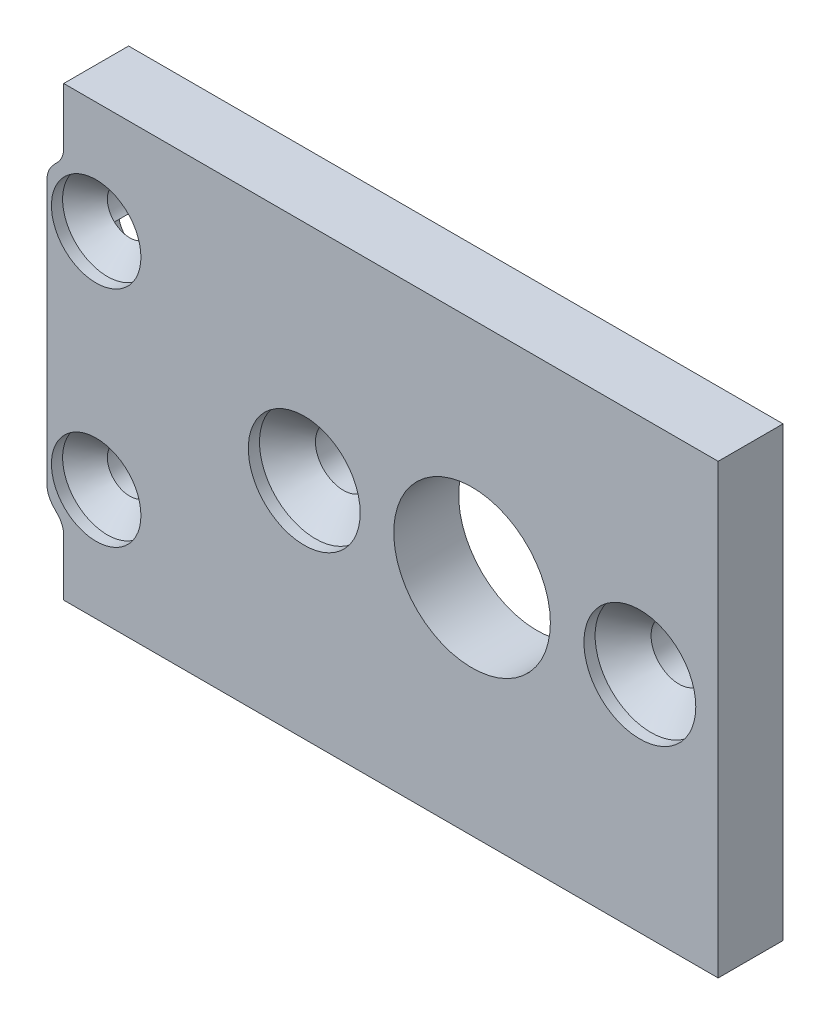
ISO-10303-21;
HEADER;
FILE_DESCRIPTION(('STEP AP214'),'2;1');
FILE_NAME('part.step','',(''),(''),'','','');
FILE_SCHEMA(('AUTOMOTIVE_DESIGN { 1 0 10303 214 1 1 1 1 }'));
ENDSEC;
DATA;
#1=APPLICATION_CONTEXT('core data for automotive mechanical design processes');
#2=APPLICATION_PROTOCOL_DEFINITION('international standard','automotive_design',2000,#1);
#3=PRODUCT_CONTEXT('',#1,'mechanical');
#4=PRODUCT('Part','Part','',(#3));
#5=PRODUCT_RELATED_PRODUCT_CATEGORY('part','',(#4));
#6=PRODUCT_DEFINITION_FORMATION('','',#4);
#7=PRODUCT_DEFINITION_CONTEXT('part definition',#1,'design');
#8=PRODUCT_DEFINITION('design','',#6,#7);
#9=PRODUCT_DEFINITION_SHAPE('','',#8);
#10=(LENGTH_UNIT() NAMED_UNIT(*) SI_UNIT(.MILLI.,.METRE.));
#11=(NAMED_UNIT(*) PLANE_ANGLE_UNIT() SI_UNIT($,.RADIAN.));
#12=(NAMED_UNIT(*) SI_UNIT($,.STERADIAN.) SOLID_ANGLE_UNIT());
#13=UNCERTAINTY_MEASURE_WITH_UNIT(LENGTH_MEASURE(1.E-05),#10,'distance_accuracy_value','');
#14=(GEOMETRIC_REPRESENTATION_CONTEXT(3) GLOBAL_UNCERTAINTY_ASSIGNED_CONTEXT((#13)) GLOBAL_UNIT_ASSIGNED_CONTEXT((#10,
#11,#12)) REPRESENTATION_CONTEXT('',''));
#15=CARTESIAN_POINT('',(0.,0.,0.));
#16=DIRECTION('',(0.,0.,1.));
#17=DIRECTION('',(1.,0.,0.));
#18=AXIS2_PLACEMENT_3D('',#15,#16,#17);
#19=CARTESIAN_POINT('',(0.,0.,-2.9));
#20=DIRECTION('',(0.,0.,1.));
#21=DIRECTION('',(1.,0.,0.));
#22=AXIS2_PLACEMENT_3D('',#19,#20,#21);
#23=PLANE('',#22);
#24=DIRECTION('',(-1.,0.,0.));
#25=VECTOR('',#24,1.);
#26=CARTESIAN_POINT('',(-92.5,10.,-2.9));
#27=LINE('',#26,#25);
#28=CARTESIAN_POINT('',(-62.5,10.,-2.9));
#29=VERTEX_POINT('',#28);
#30=CARTESIAN_POINT('',(-91.75,10.,-2.9));
#31=VERTEX_POINT('',#30);
#32=EDGE_CURVE('E478',#29,#31,#27,.T.);
#33=ORIENTED_EDGE('',*,*,#32,.F.);
#34=DIRECTION('',(0.,1.,0.));
#35=VECTOR('',#34,1.);
#36=CARTESIAN_POINT('',(-62.5,-10.,-2.9));
#37=LINE('',#36,#35);
#38=CARTESIAN_POINT('',(-62.5,-10.,-2.9));
#39=VERTEX_POINT('',#38);
#40=EDGE_CURVE('E343',#39,#29,#37,.T.);
#41=ORIENTED_EDGE('',*,*,#40,.F.);
#42=DIRECTION('',(1.,0.,0.));
#43=VECTOR('',#42,1.);
#44=CARTESIAN_POINT('',(-92.5,-10.,-2.9));
#45=LINE('',#44,#43);
#46=CARTESIAN_POINT('',(-91.75,-10.,-2.9));
#47=VERTEX_POINT('',#46);
#48=EDGE_CURVE('E477',#47,#39,#45,.T.);
#49=ORIENTED_EDGE('',*,*,#48,.F.);
#50=DIRECTION('',(0.,1.,0.));
#51=VECTOR('',#50,1.);
#52=CARTESIAN_POINT('',(-91.75,0.,-2.9));
#53=LINE('',#52,#51);
#54=CARTESIAN_POINT('',(-91.75,-7.49949994998999,-2.9));
#55=VERTEX_POINT('',#54);
#56=EDGE_CURVE('E674',#47,#55,#53,.T.);
#57=ORIENTED_EDGE('',*,*,#56,.T.);
#58=CARTESIAN_POINT('',(-92.75,-7.49949994998999,-2.9));
#59=DIRECTION('',(0.,0.,1.));
#60=DIRECTION('',(1.,0.,0.));
#61=AXIS2_PLACEMENT_3D('',#58,#59,#60);
#62=CIRCLE('',#61,1.);
#63=CARTESIAN_POINT('',(-92.05,-6.78535710713571,-2.9));
#64=VERTEX_POINT('',#63);
#65=EDGE_CURVE('E531',#55,#64,#62,.T.);
#66=ORIENTED_EDGE('',*,*,#65,.T.);
#67=CARTESIAN_POINT('',(-90.3,-5.00000000000002,-2.9));
#68=DIRECTION('',(0.,0.,1.));
#69=DIRECTION('',(1.,0.,0.));
#70=AXIS2_PLACEMENT_3D('',#67,#68,#69);
#71=CIRCLE('',#70,2.5);
#72=CARTESIAN_POINT('',(-92.3,-6.49999999999997,-2.9));
#73=VERTEX_POINT('',#72);
#74=EDGE_CURVE('E676',#64,#73,#71,.F.);
#75=ORIENTED_EDGE('',*,*,#74,.T.);
#76=CARTESIAN_POINT('',(-91.5,-5.89999999999999,-2.9));
#77=DIRECTION('',(0.,0.,1.));
#78=DIRECTION('',(1.,0.,0.));
#79=AXIS2_PLACEMENT_3D('',#76,#77,#78);
#80=CIRCLE('',#79,1.);
#81=CARTESIAN_POINT('',(-92.5,-5.89999999999999,-2.9));
#82=VERTEX_POINT('',#81);
#83=EDGE_CURVE('E519',#73,#82,#80,.F.);
#84=ORIENTED_EDGE('',*,*,#83,.T.);
#85=DIRECTION('',(0.,-1.,0.));
#86=VECTOR('',#85,1.);
#87=CARTESIAN_POINT('',(-92.5,10.,-2.9));
#88=LINE('',#87,#86);
#89=CARTESIAN_POINT('',(-92.5,5.89999999999994,-2.9));
#90=VERTEX_POINT('',#89);
#91=EDGE_CURVE('E486',#90,#82,#88,.T.);
#92=ORIENTED_EDGE('',*,*,#91,.F.);
#93=CARTESIAN_POINT('',(-91.5,5.89999999999994,-2.9));
#94=DIRECTION('',(0.,0.,1.));
#95=DIRECTION('',(1.,0.,0.));
#96=AXIS2_PLACEMENT_3D('',#93,#94,#95);
#97=CIRCLE('',#96,1.);
#98=CARTESIAN_POINT('',(-92.3,6.49999999999993,-2.9));
#99=VERTEX_POINT('',#98);
#100=EDGE_CURVE('E517',#90,#99,#97,.F.);
#101=ORIENTED_EDGE('',*,*,#100,.T.);
#102=CARTESIAN_POINT('',(-90.3,4.99999999999998,-2.9));
#103=DIRECTION('',(0.,0.,1.));
#104=DIRECTION('',(1.,0.,0.));
#105=AXIS2_PLACEMENT_3D('',#102,#103,#104);
#106=CIRCLE('',#105,2.5);
#107=CARTESIAN_POINT('',(-92.05,6.78535710713567,-2.9));
#108=VERTEX_POINT('',#107);
#109=EDGE_CURVE('E548',#99,#108,#106,.F.);
#110=ORIENTED_EDGE('',*,*,#109,.T.);
#111=CARTESIAN_POINT('',(-92.75,7.49949994998995,-2.9));
#112=DIRECTION('',(0.,0.,1.));
#113=DIRECTION('',(1.,0.,0.));
#114=AXIS2_PLACEMENT_3D('',#111,#112,#113);
#115=CIRCLE('',#114,1.);
#116=CARTESIAN_POINT('',(-91.75,7.49949994998995,-2.9));
#117=VERTEX_POINT('',#116);
#118=EDGE_CURVE('E12',#108,#117,#115,.T.);
#119=ORIENTED_EDGE('',*,*,#118,.T.);
#120=DIRECTION('',(0.,1.,0.));
#121=VECTOR('',#120,1.);
#122=CARTESIAN_POINT('',(-91.75,0.,-2.9));
#123=LINE('',#122,#121);
#124=EDGE_CURVE('E554',#117,#31,#123,.T.);
#125=ORIENTED_EDGE('',*,*,#124,.T.);
#126=EDGE_LOOP('',(#33,#41,#49,#57,#66,#75,#84,#92,#101,#110,#119,#125));
#127=FACE_BOUND('',#126,.T.);
#128=CARTESIAN_POINT('',(-66.,0.,-2.9));
#129=DIRECTION('',(0.,0.,1.));
#130=DIRECTION('',(1.,0.,0.));
#131=AXIS2_PLACEMENT_3D('',#128,#129,#130);
#132=CIRCLE('',#131,1.25);
#133=CARTESIAN_POINT('',(-64.75,0.,-2.9));
#134=VERTEX_POINT('',#133);
#135=EDGE_CURVE('E665',#134,#134,#132,.T.);
#136=ORIENTED_EDGE('',*,*,#135,.T.);
#137=EDGE_LOOP('',(#136));
#138=FACE_BOUND('',#137,.T.);
#139=CARTESIAN_POINT('',(-73.5,0.,-2.9));
#140=DIRECTION('',(0.,0.,1.));
#141=DIRECTION('',(1.,0.,0.));
#142=AXIS2_PLACEMENT_3D('',#139,#140,#141);
#143=CIRCLE('',#142,3.50000000000001);
#144=CARTESIAN_POINT('',(-70.,0.,-2.9));
#145=VERTEX_POINT('',#144);
#146=EDGE_CURVE('E659',#145,#145,#143,.F.);
#147=ORIENTED_EDGE('',*,*,#146,.F.);
#148=EDGE_LOOP('',(#147));
#149=FACE_BOUND('',#148,.T.);
#150=CARTESIAN_POINT('',(-81.,0.,-2.9));
#151=DIRECTION('',(0.,0.,1.));
#152=DIRECTION('',(1.,0.,0.));
#153=AXIS2_PLACEMENT_3D('',#150,#151,#152);
#154=CIRCLE('',#153,1.25);
#155=CARTESIAN_POINT('',(-79.75,0.,-2.9));
#156=VERTEX_POINT('',#155);
#157=EDGE_CURVE('E499',#156,#156,#154,.F.);
#158=ORIENTED_EDGE('',*,*,#157,.F.);
#159=EDGE_LOOP('',(#158));
#160=FACE_BOUND('',#159,.T.);
#161=CARTESIAN_POINT('',(-90.3,-5.00000000000002,-2.9));
#162=DIRECTION('',(0.,0.,1.));
#163=DIRECTION('',(1.,0.,0.));
#164=AXIS2_PLACEMENT_3D('',#161,#162,#163);
#165=CIRCLE('',#164,0.999999999999998);
#166=CARTESIAN_POINT('',(-89.6155672359768,-4.27092401525527,-2.9));
#167=VERTEX_POINT('',#166);
#168=CARTESIAN_POINT('',(-90.9844327640232,-4.27092401525527,-2.9));
#169=VERTEX_POINT('',#168);
#170=EDGE_CURVE('E634',#167,#169,#165,.F.);
#171=ORIENTED_EDGE('',*,*,#170,.F.);
#172=CARTESIAN_POINT('',(-89.4071067811865,-3.29289321881344,-2.9));
#173=DIRECTION('',(0.,0.,-1.));
#174=DIRECTION('',(-1.,0.,0.));
#175=AXIS2_PLACEMENT_3D('',#172,#173,#174);
#176=CIRCLE('',#175,0.999999999999998);
#177=CARTESIAN_POINT('',(-88.7,-2.58578643762689,-2.9));
#178=VERTEX_POINT('',#177);
#179=EDGE_CURVE('E556',#178,#167,#176,.T.);
#180=ORIENTED_EDGE('',*,*,#179,.F.);
#181=DIRECTION('',(0.,-1.,0.));
#182=VECTOR('',#181,1.);
#183=CARTESIAN_POINT('',(-88.7,4.00000000000002,-2.9));
#184=LINE('',#183,#182);
#185=CARTESIAN_POINT('',(-88.7,2.58578643762689,-2.9));
#186=VERTEX_POINT('',#185);
#187=EDGE_CURVE('E583',#186,#178,#184,.T.);
#188=ORIENTED_EDGE('',*,*,#187,.F.);
#189=CARTESIAN_POINT('',(-89.4071067811865,3.29289321881344,-2.9));
#190=DIRECTION('',(0.,0.,1.));
#191=DIRECTION('',(1.,0.,0.));
#192=AXIS2_PLACEMENT_3D('',#189,#190,#191);
#193=CIRCLE('',#192,0.999999999999998);
#194=CARTESIAN_POINT('',(-89.6155672359767,4.27092401525529,-2.9));
#195=VERTEX_POINT('',#194);
#196=EDGE_CURVE('E592',#186,#195,#193,.T.);
#197=ORIENTED_EDGE('',*,*,#196,.T.);
#198=CARTESIAN_POINT('',(-90.3,4.99999999999998,-2.9));
#199=DIRECTION('',(0.,0.,1.));
#200=DIRECTION('',(1.,0.,0.));
#201=AXIS2_PLACEMENT_3D('',#198,#199,#200);
#202=CIRCLE('',#201,0.999999999999998);
#203=CARTESIAN_POINT('',(-90.9844327640233,4.27092401525528,-2.9));
#204=VERTEX_POINT('',#203);
#205=EDGE_CURVE('E633',#204,#195,#202,.F.);
#206=ORIENTED_EDGE('',*,*,#205,.F.);
#207=CARTESIAN_POINT('',(-91.1928932188135,3.29289321881344,-2.9));
#208=DIRECTION('',(0.,0.,-1.));
#209=DIRECTION('',(-1.,0.,0.));
#210=AXIS2_PLACEMENT_3D('',#207,#208,#209);
#211=CIRCLE('',#210,0.999999999999998);
#212=CARTESIAN_POINT('',(-91.9,2.58578643762685,-2.9));
#213=VERTEX_POINT('',#212);
#214=EDGE_CURVE('E598',#213,#204,#211,.T.);
#215=ORIENTED_EDGE('',*,*,#214,.F.);
#216=DIRECTION('',(0.,-1.,0.));
#217=VECTOR('',#216,1.);
#218=CARTESIAN_POINT('',(-91.9,4.00000000000002,-2.9));
#219=LINE('',#218,#217);
#220=CARTESIAN_POINT('',(-91.9,-2.58578643762685,-2.9));
#221=VERTEX_POINT('',#220);
#222=EDGE_CURVE('E579',#213,#221,#219,.T.);
#223=ORIENTED_EDGE('',*,*,#222,.T.);
#224=CARTESIAN_POINT('',(-91.1928932188135,-3.29289321881344,-2.9));
#225=DIRECTION('',(0.,0.,1.));
#226=DIRECTION('',(1.,0.,0.));
#227=AXIS2_PLACEMENT_3D('',#224,#225,#226);
#228=CIRCLE('',#227,0.999999999999998);
#229=EDGE_CURVE('E604',#221,#169,#228,.T.);
#230=ORIENTED_EDGE('',*,*,#229,.T.);
#231=EDGE_LOOP('',(#171,#180,#188,#197,#206,#215,#223,#230));
#232=FACE_BOUND('',#231,.T.);
#233=ADVANCED_FACE('F328',(#127,#138,#149,#160,#232),#23,.F.);
#234=CARTESIAN_POINT('',(0.,0.,0.));
#235=DIRECTION('',(0.,0.,1.));
#236=DIRECTION('',(1.,0.,0.));
#237=AXIS2_PLACEMENT_3D('',#234,#235,#236);
#238=PLANE('',#237);
#239=DIRECTION('',(0.,-1.,0.));
#240=VECTOR('',#239,1.);
#241=CARTESIAN_POINT('',(-62.5,-10.,0.));
#242=LINE('',#241,#240);
#243=CARTESIAN_POINT('',(-62.5,10.,0.));
#244=VERTEX_POINT('',#243);
#245=CARTESIAN_POINT('',(-62.5,-10.,0.));
#246=VERTEX_POINT('',#245);
#247=EDGE_CURVE('E466',#244,#246,#242,.T.);
#248=ORIENTED_EDGE('',*,*,#247,.F.);
#249=DIRECTION('',(-1.,0.,0.));
#250=VECTOR('',#249,1.);
#251=CARTESIAN_POINT('',(-92.5,10.,0.));
#252=LINE('',#251,#250);
#253=CARTESIAN_POINT('',(-91.75,10.,0.));
#254=VERTEX_POINT('',#253);
#255=EDGE_CURVE('E496',#244,#254,#252,.T.);
#256=ORIENTED_EDGE('',*,*,#255,.T.);
#257=DIRECTION('',(0.,-1.,0.));
#258=VECTOR('',#257,1.);
#259=CARTESIAN_POINT('',(-91.75,0.,0.));
#260=LINE('',#259,#258);
#261=CARTESIAN_POINT('',(-91.75,7.49949994998995,0.));
#262=VERTEX_POINT('',#261);
#263=EDGE_CURVE('E540',#254,#262,#260,.T.);
#264=ORIENTED_EDGE('',*,*,#263,.T.);
#265=CARTESIAN_POINT('',(-92.75,7.49949994998995,0.));
#266=DIRECTION('',(0.,0.,1.));
#267=DIRECTION('',(1.,0.,0.));
#268=AXIS2_PLACEMENT_3D('',#265,#266,#267);
#269=CIRCLE('',#268,1.);
#270=CARTESIAN_POINT('',(-92.05,6.78535710713567,0.));
#271=VERTEX_POINT('',#270);
#272=EDGE_CURVE('E336',#262,#271,#269,.F.);
#273=ORIENTED_EDGE('',*,*,#272,.T.);
#274=CARTESIAN_POINT('',(-90.3,4.99999999999998,0.));
#275=DIRECTION('',(0.,0.,1.));
#276=DIRECTION('',(1.,0.,0.));
#277=AXIS2_PLACEMENT_3D('',#274,#275,#276);
#278=CIRCLE('',#277,2.5);
#279=CARTESIAN_POINT('',(-92.3,6.49999999999993,0.));
#280=VERTEX_POINT('',#279);
#281=EDGE_CURVE('E538',#271,#280,#278,.T.);
#282=ORIENTED_EDGE('',*,*,#281,.T.);
#283=CARTESIAN_POINT('',(-91.5,5.89999999999994,0.));
#284=DIRECTION('',(0.,0.,1.));
#285=DIRECTION('',(1.,0.,0.));
#286=AXIS2_PLACEMENT_3D('',#283,#284,#285);
#287=CIRCLE('',#286,1.);
#288=CARTESIAN_POINT('',(-92.5,5.89999999999994,0.));
#289=VERTEX_POINT('',#288);
#290=EDGE_CURVE('E513',#280,#289,#287,.T.);
#291=ORIENTED_EDGE('',*,*,#290,.T.);
#292=DIRECTION('',(0.,-1.,0.));
#293=VECTOR('',#292,1.);
#294=CARTESIAN_POINT('',(-92.5,10.,0.));
#295=LINE('',#294,#293);
#296=CARTESIAN_POINT('',(-92.5,-5.89999999999999,0.));
#297=VERTEX_POINT('',#296);
#298=EDGE_CURVE('E498',#289,#297,#295,.T.);
#299=ORIENTED_EDGE('',*,*,#298,.T.);
#300=CARTESIAN_POINT('',(-91.5,-5.89999999999999,0.));
#301=DIRECTION('',(0.,0.,1.));
#302=DIRECTION('',(1.,0.,0.));
#303=AXIS2_PLACEMENT_3D('',#300,#301,#302);
#304=CIRCLE('',#303,1.);
#305=CARTESIAN_POINT('',(-92.3,-6.49999999999997,0.));
#306=VERTEX_POINT('',#305);
#307=EDGE_CURVE('E515',#297,#306,#304,.T.);
#308=ORIENTED_EDGE('',*,*,#307,.T.);
#309=CARTESIAN_POINT('',(-90.3,-5.00000000000002,0.));
#310=DIRECTION('',(0.,0.,1.));
#311=DIRECTION('',(1.,0.,0.));
#312=AXIS2_PLACEMENT_3D('',#309,#310,#311);
#313=CIRCLE('',#312,2.5);
#314=CARTESIAN_POINT('',(-92.05,-6.78535710713571,0.));
#315=VERTEX_POINT('',#314);
#316=EDGE_CURVE('E682',#306,#315,#313,.T.);
#317=ORIENTED_EDGE('',*,*,#316,.T.);
#318=CARTESIAN_POINT('',(-92.75,-7.49949994998999,0.));
#319=DIRECTION('',(0.,0.,1.));
#320=DIRECTION('',(1.,0.,0.));
#321=AXIS2_PLACEMENT_3D('',#318,#319,#320);
#322=CIRCLE('',#321,1.);
#323=CARTESIAN_POINT('',(-91.75,-7.49949994998999,0.));
#324=VERTEX_POINT('',#323);
#325=EDGE_CURVE('E529',#315,#324,#322,.F.);
#326=ORIENTED_EDGE('',*,*,#325,.T.);
#327=DIRECTION('',(0.,-1.,0.));
#328=VECTOR('',#327,1.);
#329=CARTESIAN_POINT('',(-91.75,0.,0.));
#330=LINE('',#329,#328);
#331=CARTESIAN_POINT('',(-91.75,-10.,0.));
#332=VERTEX_POINT('',#331);
#333=EDGE_CURVE('E685',#324,#332,#330,.T.);
#334=ORIENTED_EDGE('',*,*,#333,.T.);
#335=DIRECTION('',(1.,0.,0.));
#336=VECTOR('',#335,1.);
#337=CARTESIAN_POINT('',(-92.5,-10.,0.));
#338=LINE('',#337,#336);
#339=EDGE_CURVE('E502',#332,#246,#338,.T.);
#340=ORIENTED_EDGE('',*,*,#339,.T.);
#341=EDGE_LOOP('',(#248,#256,#264,#273,#282,#291,#299,#308,#317,#326,#334,#340));
#342=FACE_BOUND('',#341,.T.);
#343=CARTESIAN_POINT('',(-90.3,4.99999999999998,0.));
#344=DIRECTION('',(0.,0.,1.));
#345=DIRECTION('',(1.,0.,0.));
#346=AXIS2_PLACEMENT_3D('',#343,#344,#345);
#347=CIRCLE('',#346,2.);
#348=CARTESIAN_POINT('',(-88.3,4.99999999999998,0.));
#349=VERTEX_POINT('',#348);
#350=EDGE_CURVE('E565',#349,#349,#347,.T.);
#351=ORIENTED_EDGE('',*,*,#350,.F.);
#352=EDGE_LOOP('',(#351));
#353=FACE_BOUND('',#352,.T.);
#354=CARTESIAN_POINT('',(-90.3,-5.00000000000002,0.));
#355=DIRECTION('',(0.,0.,1.));
#356=DIRECTION('',(1.,0.,0.));
#357=AXIS2_PLACEMENT_3D('',#354,#355,#356);
#358=CIRCLE('',#357,2.);
#359=CARTESIAN_POINT('',(-88.3,-5.00000000000002,0.));
#360=VERTEX_POINT('',#359);
#361=EDGE_CURVE('E623',#360,#360,#358,.T.);
#362=ORIENTED_EDGE('',*,*,#361,.F.);
#363=EDGE_LOOP('',(#362));
#364=FACE_BOUND('',#363,.T.);
#365=CARTESIAN_POINT('',(-81.,0.,0.));
#366=DIRECTION('',(0.,0.,1.));
#367=DIRECTION('',(1.,0.,0.));
#368=AXIS2_PLACEMENT_3D('',#365,#366,#367);
#369=CIRCLE('',#368,2.5);
#370=CARTESIAN_POINT('',(-78.5,0.,0.));
#371=VERTEX_POINT('',#370);
#372=EDGE_CURVE('E638',#371,#371,#369,.T.);
#373=ORIENTED_EDGE('',*,*,#372,.F.);
#374=EDGE_LOOP('',(#373));
#375=FACE_BOUND('',#374,.T.);
#376=CARTESIAN_POINT('',(-66.,0.,0.));
#377=DIRECTION('',(0.,0.,1.));
#378=DIRECTION('',(1.,0.,0.));
#379=AXIS2_PLACEMENT_3D('',#376,#377,#378);
#380=CIRCLE('',#379,2.5);
#381=CARTESIAN_POINT('',(-63.5,0.,0.));
#382=VERTEX_POINT('',#381);
#383=EDGE_CURVE('E650',#382,#382,#380,.T.);
#384=ORIENTED_EDGE('',*,*,#383,.F.);
#385=EDGE_LOOP('',(#384));
#386=FACE_BOUND('',#385,.T.);
#387=CARTESIAN_POINT('',(-73.5,0.,0.));
#388=DIRECTION('',(0.,0.,1.));
#389=DIRECTION('',(1.,0.,0.));
#390=AXIS2_PLACEMENT_3D('',#387,#388,#389);
#391=CIRCLE('',#390,3.50000000000001);
#392=CARTESIAN_POINT('',(-70.,0.,0.));
#393=VERTEX_POINT('',#392);
#394=EDGE_CURVE('E662',#393,#393,#391,.T.);
#395=ORIENTED_EDGE('',*,*,#394,.F.);
#396=EDGE_LOOP('',(#395));
#397=FACE_BOUND('',#396,.T.);
#398=ADVANCED_FACE('F536',(#342,#353,#364,#375,#386,#397),#238,.T.);
#399=CARTESIAN_POINT('',(-92.5,10.,-2.9));
#400=DIRECTION('',(-1.,0.,0.));
#401=DIRECTION('',(0.,0.,1.));
#402=AXIS2_PLACEMENT_3D('',#399,#400,#401);
#403=PLANE('',#402);
#404=ORIENTED_EDGE('',*,*,#91,.T.);
#405=DIRECTION('',(0.,0.,1.));
#406=VECTOR('',#405,1.);
#407=CARTESIAN_POINT('',(-92.5,-5.89999999999999,-2.9));
#408=LINE('',#407,#406);
#409=EDGE_CURVE('E510',#82,#297,#408,.T.);
#410=ORIENTED_EDGE('',*,*,#409,.T.);
#411=ORIENTED_EDGE('',*,*,#298,.F.);
#412=DIRECTION('',(0.,0.,1.));
#413=VECTOR('',#412,1.);
#414=CARTESIAN_POINT('',(-92.5,5.89999999999994,-2.9));
#415=LINE('',#414,#413);
#416=EDGE_CURVE('E508',#289,#90,#415,.F.);
#417=ORIENTED_EDGE('',*,*,#416,.T.);
#418=EDGE_LOOP('',(#404,#410,#411,#417));
#419=FACE_BOUND('',#418,.T.);
#420=ADVANCED_FACE('F695',(#419),#403,.T.);
#421=CARTESIAN_POINT('',(-92.5,-10.,-2.9));
#422=DIRECTION('',(0.,-1.,0.));
#423=DIRECTION('',(0.,0.,-1.));
#424=AXIS2_PLACEMENT_3D('',#421,#422,#423);
#425=PLANE('',#424);
#426=DIRECTION('',(0.,0.,1.));
#427=VECTOR('',#426,1.);
#428=CARTESIAN_POINT('',(-62.5,-10.,-2.901));
#429=LINE('',#428,#427);
#430=EDGE_CURVE('E463',#39,#246,#429,.T.);
#431=ORIENTED_EDGE('',*,*,#430,.T.);
#432=ORIENTED_EDGE('',*,*,#339,.F.);
#433=DIRECTION('',(0.,0.,1.));
#434=VECTOR('',#433,1.);
#435=CARTESIAN_POINT('',(-91.75,-10.,-2.901));
#436=LINE('',#435,#434);
#437=EDGE_CURVE('E483',#47,#332,#436,.T.);
#438=ORIENTED_EDGE('',*,*,#437,.F.);
#439=ORIENTED_EDGE('',*,*,#48,.T.);
#440=EDGE_LOOP('',(#431,#432,#438,#439));
#441=FACE_BOUND('',#440,.T.);
#442=ADVANCED_FACE('F481',(#441),#425,.T.);
#443=CARTESIAN_POINT('',(-92.5,10.,-2.9));
#444=DIRECTION('',(0.,1.,0.));
#445=DIRECTION('',(0.,0.,1.));
#446=AXIS2_PLACEMENT_3D('',#443,#444,#445);
#447=PLANE('',#446);
#448=DIRECTION('',(0.,0.,1.));
#449=VECTOR('',#448,1.);
#450=CARTESIAN_POINT('',(-62.5,10.,-2.901));
#451=LINE('',#450,#449);
#452=EDGE_CURVE('E471',#29,#244,#451,.T.);
#453=ORIENTED_EDGE('',*,*,#452,.F.);
#454=ORIENTED_EDGE('',*,*,#32,.T.);
#455=DIRECTION('',(0.,0.,1.));
#456=VECTOR('',#455,1.);
#457=CARTESIAN_POINT('',(-91.75,10.,-2.901));
#458=LINE('',#457,#456);
#459=EDGE_CURVE('E555',#31,#254,#458,.T.);
#460=ORIENTED_EDGE('',*,*,#459,.T.);
#461=ORIENTED_EDGE('',*,*,#255,.F.);
#462=EDGE_LOOP('',(#453,#454,#460,#461));
#463=FACE_BOUND('',#462,.T.);
#464=ADVANCED_FACE('F672',(#463),#447,.T.);
#465=CARTESIAN_POINT('',(-90.3,4.99999999999998,-2.901));
#466=DIRECTION('',(0.,0.,1.));
#467=DIRECTION('',(1.,0.,0.));
#468=AXIS2_PLACEMENT_3D('',#465,#466,#467);
#469=CYLINDRICAL_SURFACE('',#468,0.999999999999998);
#470=DIRECTION('',(0.,0.,-1.));
#471=VECTOR('',#470,1.);
#472=CARTESIAN_POINT('',(-89.6155672359767,4.27092401525529,-1.5));
#473=LINE('',#472,#471);
#474=CARTESIAN_POINT('',(-89.6155672359767,4.27092401525529,-1.5));
#475=VERTEX_POINT('',#474);
#476=EDGE_CURVE('E563',#475,#195,#473,.T.);
#477=ORIENTED_EDGE('',*,*,#476,.F.);
#478=CARTESIAN_POINT('',(-90.3,4.99999999999998,-1.5));
#479=DIRECTION('',(0.,0.,1.));
#480=DIRECTION('',(1.,0.,0.));
#481=AXIS2_PLACEMENT_3D('',#478,#479,#480);
#482=CIRCLE('',#481,1.);
#483=CARTESIAN_POINT('',(-90.9844327640233,4.27092401525528,-1.5));
#484=VERTEX_POINT('',#483);
#485=EDGE_CURVE('E619',#475,#484,#482,.T.);
#486=ORIENTED_EDGE('',*,*,#485,.T.);
#487=DIRECTION('',(0.,0.,-1.));
#488=VECTOR('',#487,1.);
#489=CARTESIAN_POINT('',(-90.9844327640233,4.27092401525528,-1.5));
#490=LINE('',#489,#488);
#491=EDGE_CURVE('E566',#484,#204,#490,.T.);
#492=ORIENTED_EDGE('',*,*,#491,.T.);
#493=ORIENTED_EDGE('',*,*,#205,.T.);
#494=EDGE_LOOP('',(#477,#486,#492,#493));
#495=FACE_BOUND('',#494,.T.);
#496=ADVANCED_FACE('F737',(#495),#469,.F.);
#497=CARTESIAN_POINT('',(-73.5,0.,-2.901));
#498=DIRECTION('',(0.,0.,1.));
#499=DIRECTION('',(1.,0.,0.));
#500=AXIS2_PLACEMENT_3D('',#497,#498,#499);
#501=CYLINDRICAL_SURFACE('',#500,3.50000000000001);
#502=ORIENTED_EDGE('',*,*,#394,.T.);
#503=EDGE_LOOP('',(#502));
#504=FACE_BOUND('',#503,.T.);
#505=ORIENTED_EDGE('',*,*,#146,.T.);
#506=EDGE_LOOP('',(#505));
#507=FACE_BOUND('',#506,.T.);
#508=ADVANCED_FACE('F942',(#504,#507),#501,.F.);
#509=CARTESIAN_POINT('',(-66.,0.,-2.901));
#510=DIRECTION('',(0.,0.,1.));
#511=DIRECTION('',(1.,0.,0.));
#512=AXIS2_PLACEMENT_3D('',#509,#510,#511);
#513=CYLINDRICAL_SURFACE('',#512,1.25);
#514=CARTESIAN_POINT('',(-66.,0.,-1.75));
#515=DIRECTION('',(0.,0.,1.));
#516=DIRECTION('',(1.,0.,0.));
#517=AXIS2_PLACEMENT_3D('',#514,#515,#516);
#518=CIRCLE('',#517,1.25);
#519=CARTESIAN_POINT('',(-64.75,0.,-1.75));
#520=VERTEX_POINT('',#519);
#521=EDGE_CURVE('E656',#520,#520,#518,.T.);
#522=ORIENTED_EDGE('',*,*,#521,.T.);
#523=EDGE_LOOP('',(#522));
#524=FACE_BOUND('',#523,.T.);
#525=ORIENTED_EDGE('',*,*,#135,.F.);
#526=EDGE_LOOP('',(#525));
#527=FACE_BOUND('',#526,.T.);
#528=ADVANCED_FACE('F729',(#524,#527),#513,.F.);
#529=CARTESIAN_POINT('',(-81.,0.,-2.901));
#530=DIRECTION('',(0.,0.,1.));
#531=DIRECTION('',(1.,0.,0.));
#532=AXIS2_PLACEMENT_3D('',#529,#530,#531);
#533=CYLINDRICAL_SURFACE('',#532,1.25);
#534=CARTESIAN_POINT('',(-81.,0.,-1.75));
#535=DIRECTION('',(0.,0.,1.));
#536=DIRECTION('',(1.,0.,0.));
#537=AXIS2_PLACEMENT_3D('',#534,#535,#536);
#538=CIRCLE('',#537,1.25);
#539=CARTESIAN_POINT('',(-79.75,0.,-1.75));
#540=VERTEX_POINT('',#539);
#541=EDGE_CURVE('E647',#540,#540,#538,.T.);
#542=ORIENTED_EDGE('',*,*,#541,.T.);
#543=EDGE_LOOP('',(#542));
#544=FACE_BOUND('',#543,.T.);
#545=ORIENTED_EDGE('',*,*,#157,.T.);
#546=EDGE_LOOP('',(#545));
#547=FACE_BOUND('',#546,.T.);
#548=ADVANCED_FACE('F997',(#544,#547),#533,.F.);
#549=CARTESIAN_POINT('',(-66.,0.,-0.5));
#550=DIRECTION('',(0.,0.,1.));
#551=DIRECTION('',(1.,0.,0.));
#552=AXIS2_PLACEMENT_3D('',#549,#550,#551);
#553=CONICAL_SURFACE('',#552,2.5,0.785398163397449);
#554=ORIENTED_EDGE('',*,*,#521,.F.);
#555=EDGE_LOOP('',(#554));
#556=FACE_BOUND('',#555,.T.);
#557=CARTESIAN_POINT('',(-66.,0.,-0.5));
#558=DIRECTION('',(0.,0.,1.));
#559=DIRECTION('',(1.,0.,0.));
#560=AXIS2_PLACEMENT_3D('',#557,#558,#559);
#561=CIRCLE('',#560,2.5);
#562=CARTESIAN_POINT('',(-63.5,0.,-0.5));
#563=VERTEX_POINT('',#562);
#564=EDGE_CURVE('E653',#563,#563,#561,.T.);
#565=ORIENTED_EDGE('',*,*,#564,.T.);
#566=EDGE_LOOP('',(#565));
#567=FACE_BOUND('',#566,.T.);
#568=ADVANCED_FACE('F987',(#556,#567),#553,.F.);
#569=CARTESIAN_POINT('',(-66.,0.,0.));
#570=DIRECTION('',(0.,0.,1.));
#571=DIRECTION('',(1.,0.,0.));
#572=AXIS2_PLACEMENT_3D('',#569,#570,#571);
#573=CYLINDRICAL_SURFACE('',#572,2.5);
#574=ORIENTED_EDGE('',*,*,#564,.F.);
#575=EDGE_LOOP('',(#574));
#576=FACE_BOUND('',#575,.T.);
#577=ORIENTED_EDGE('',*,*,#383,.T.);
#578=EDGE_LOOP('',(#577));
#579=FACE_BOUND('',#578,.T.);
#580=ADVANCED_FACE('F978',(#576,#579),#573,.F.);
#581=CARTESIAN_POINT('',(-81.,0.,-0.5));
#582=DIRECTION('',(0.,0.,1.));
#583=DIRECTION('',(1.,0.,0.));
#584=AXIS2_PLACEMENT_3D('',#581,#582,#583);
#585=CONICAL_SURFACE('',#584,2.5,0.785398163397449);
#586=ORIENTED_EDGE('',*,*,#541,.F.);
#587=EDGE_LOOP('',(#586));
#588=FACE_BOUND('',#587,.T.);
#589=CARTESIAN_POINT('',(-81.,0.,-0.5));
#590=DIRECTION('',(0.,0.,1.));
#591=DIRECTION('',(1.,0.,0.));
#592=AXIS2_PLACEMENT_3D('',#589,#590,#591);
#593=CIRCLE('',#592,2.5);
#594=CARTESIAN_POINT('',(-78.5,0.,-0.5));
#595=VERTEX_POINT('',#594);
#596=EDGE_CURVE('E644',#595,#595,#593,.T.);
#597=ORIENTED_EDGE('',*,*,#596,.T.);
#598=EDGE_LOOP('',(#597));
#599=FACE_BOUND('',#598,.T.);
#600=ADVANCED_FACE('F967',(#588,#599),#585,.F.);
#601=CARTESIAN_POINT('',(-81.,0.,0.));
#602=DIRECTION('',(0.,0.,1.));
#603=DIRECTION('',(1.,0.,0.));
#604=AXIS2_PLACEMENT_3D('',#601,#602,#603);
#605=CYLINDRICAL_SURFACE('',#604,2.5);
#606=ORIENTED_EDGE('',*,*,#596,.F.);
#607=EDGE_LOOP('',(#606));
#608=FACE_BOUND('',#607,.T.);
#609=ORIENTED_EDGE('',*,*,#372,.T.);
#610=EDGE_LOOP('',(#609));
#611=FACE_BOUND('',#610,.T.);
#612=ADVANCED_FACE('F931',(#608,#611),#605,.F.);
#613=CARTESIAN_POINT('',(-90.3,-5.00000000000002,-2.901));
#614=DIRECTION('',(0.,0.,1.));
#615=DIRECTION('',(1.,0.,0.));
#616=AXIS2_PLACEMENT_3D('',#613,#614,#615);
#617=CYLINDRICAL_SURFACE('',#616,0.999999999999998);
#618=CARTESIAN_POINT('',(-90.3,-5.00000000000002,-1.5));
#619=DIRECTION('',(0.,0.,1.));
#620=DIRECTION('',(1.,0.,0.));
#621=AXIS2_PLACEMENT_3D('',#618,#619,#620);
#622=CIRCLE('',#621,1.);
#623=CARTESIAN_POINT('',(-90.9844327640232,-4.27092401525527,-1.5));
#624=VERTEX_POINT('',#623);
#625=CARTESIAN_POINT('',(-89.6155672359768,-4.27092401525527,-1.5));
#626=VERTEX_POINT('',#625);
#627=EDGE_CURVE('E629',#624,#626,#622,.T.);
#628=ORIENTED_EDGE('',*,*,#627,.T.);
#629=DIRECTION('',(0.,0.,-1.));
#630=VECTOR('',#629,1.);
#631=CARTESIAN_POINT('',(-89.6155672359768,-4.27092401525527,-1.5));
#632=LINE('',#631,#630);
#633=EDGE_CURVE('E569',#626,#167,#632,.T.);
#634=ORIENTED_EDGE('',*,*,#633,.T.);
#635=ORIENTED_EDGE('',*,*,#170,.T.);
#636=DIRECTION('',(0.,0.,-1.));
#637=VECTOR('',#636,1.);
#638=CARTESIAN_POINT('',(-90.9844327640232,-4.27092401525527,-1.5));
#639=LINE('',#638,#637);
#640=EDGE_CURVE('E572',#624,#169,#639,.T.);
#641=ORIENTED_EDGE('',*,*,#640,.F.);
#642=EDGE_LOOP('',(#628,#634,#635,#641));
#643=FACE_BOUND('',#642,.T.);
#644=ADVANCED_FACE('F921',(#643),#617,.F.);
#645=CARTESIAN_POINT('',(-90.3,-5.00000000000002,-0.5));
#646=DIRECTION('',(0.,0.,1.));
#647=DIRECTION('',(1.,0.,0.));
#648=AXIS2_PLACEMENT_3D('',#645,#646,#647);
#649=CONICAL_SURFACE('',#648,2.,0.785398163397449);
#650=EDGE_CURVE('E630',#626,#624,#622,.T.);
#651=ORIENTED_EDGE('',*,*,#650,.F.);
#652=ORIENTED_EDGE('',*,*,#627,.F.);
#653=EDGE_LOOP('',(#651,#652));
#654=FACE_BOUND('',#653,.T.);
#655=CARTESIAN_POINT('',(-90.3,-5.00000000000002,-0.5));
#656=DIRECTION('',(0.,0.,1.));
#657=DIRECTION('',(1.,0.,0.));
#658=AXIS2_PLACEMENT_3D('',#655,#656,#657);
#659=CIRCLE('',#658,2.);
#660=CARTESIAN_POINT('',(-88.3,-5.00000000000002,-0.5));
#661=VERTEX_POINT('',#660);
#662=EDGE_CURVE('E626',#661,#661,#659,.T.);
#663=ORIENTED_EDGE('',*,*,#662,.T.);
#664=EDGE_LOOP('',(#663));
#665=FACE_BOUND('',#664,.T.);
#666=ADVANCED_FACE('F916',(#654,#665),#649,.F.);
#667=CARTESIAN_POINT('',(-90.3,-5.00000000000002,0.));
#668=DIRECTION('',(0.,0.,1.));
#669=DIRECTION('',(1.,0.,0.));
#670=AXIS2_PLACEMENT_3D('',#667,#668,#669);
#671=CYLINDRICAL_SURFACE('',#670,2.);
#672=ORIENTED_EDGE('',*,*,#662,.F.);
#673=EDGE_LOOP('',(#672));
#674=FACE_BOUND('',#673,.T.);
#675=ORIENTED_EDGE('',*,*,#361,.T.);
#676=EDGE_LOOP('',(#675));
#677=FACE_BOUND('',#676,.T.);
#678=ADVANCED_FACE('F908',(#674,#677),#671,.F.);
#679=CARTESIAN_POINT('',(-90.3,4.99999999999998,-0.5));
#680=DIRECTION('',(0.,0.,1.));
#681=DIRECTION('',(1.,0.,0.));
#682=AXIS2_PLACEMENT_3D('',#679,#680,#681);
#683=CONICAL_SURFACE('',#682,2.,0.785398163397449);
#684=EDGE_CURVE('E620',#484,#475,#482,.T.);
#685=ORIENTED_EDGE('',*,*,#684,.F.);
#686=ORIENTED_EDGE('',*,*,#485,.F.);
#687=EDGE_LOOP('',(#685,#686));
#688=FACE_BOUND('',#687,.T.);
#689=CARTESIAN_POINT('',(-90.3,4.99999999999998,-0.5));
#690=DIRECTION('',(0.,0.,1.));
#691=DIRECTION('',(1.,0.,0.));
#692=AXIS2_PLACEMENT_3D('',#689,#690,#691);
#693=CIRCLE('',#692,2.);
#694=CARTESIAN_POINT('',(-88.3,4.99999999999998,-0.5));
#695=VERTEX_POINT('',#694);
#696=EDGE_CURVE('E616',#695,#695,#693,.T.);
#697=ORIENTED_EDGE('',*,*,#696,.T.);
#698=EDGE_LOOP('',(#697));
#699=FACE_BOUND('',#698,.T.);
#700=ADVANCED_FACE('F902',(#688,#699),#683,.F.);
#701=CARTESIAN_POINT('',(-90.3,4.99999999999998,0.));
#702=DIRECTION('',(0.,0.,1.));
#703=DIRECTION('',(1.,0.,0.));
#704=AXIS2_PLACEMENT_3D('',#701,#702,#703);
#705=CYLINDRICAL_SURFACE('',#704,2.);
#706=ORIENTED_EDGE('',*,*,#696,.F.);
#707=EDGE_LOOP('',(#706));
#708=FACE_BOUND('',#707,.T.);
#709=ORIENTED_EDGE('',*,*,#350,.T.);
#710=EDGE_LOOP('',(#709));
#711=FACE_BOUND('',#710,.T.);
#712=ADVANCED_FACE('F894',(#708,#711),#705,.F.);
#713=CARTESIAN_POINT('',(0.,0.,-1.5));
#714=DIRECTION('',(0.,0.,-1.));
#715=DIRECTION('',(-1.,0.,0.));
#716=AXIS2_PLACEMENT_3D('',#713,#714,#715);
#717=PLANE('',#716);
#718=ORIENTED_EDGE('',*,*,#650,.T.);
#719=CARTESIAN_POINT('',(-91.1928932188135,-3.29289321881344,-1.5));
#720=DIRECTION('',(0.,0.,1.));
#721=DIRECTION('',(1.,0.,0.));
#722=AXIS2_PLACEMENT_3D('',#719,#720,#721);
#723=CIRCLE('',#722,0.999999999999998);
#724=CARTESIAN_POINT('',(-91.9,-2.58578643762685,-1.5));
#725=VERTEX_POINT('',#724);
#726=EDGE_CURVE('E600',#725,#624,#723,.T.);
#727=ORIENTED_EDGE('',*,*,#726,.F.);
#728=DIRECTION('',(0.,-1.,0.));
#729=VECTOR('',#728,1.);
#730=CARTESIAN_POINT('',(-91.9,4.00000000000002,-1.5));
#731=LINE('',#730,#729);
#732=CARTESIAN_POINT('',(-91.9,2.58578643762685,-1.5));
#733=VERTEX_POINT('',#732);
#734=EDGE_CURVE('E578',#733,#725,#731,.T.);
#735=ORIENTED_EDGE('',*,*,#734,.F.);
#736=CARTESIAN_POINT('',(-91.1928932188135,3.29289321881344,-1.5));
#737=DIRECTION('',(0.,0.,-1.));
#738=DIRECTION('',(-1.,0.,0.));
#739=AXIS2_PLACEMENT_3D('',#736,#737,#738);
#740=CIRCLE('',#739,0.999999999999998);
#741=EDGE_CURVE('E595',#733,#484,#740,.T.);
#742=ORIENTED_EDGE('',*,*,#741,.T.);
#743=ORIENTED_EDGE('',*,*,#684,.T.);
#744=CARTESIAN_POINT('',(-89.4071067811865,3.29289321881344,-1.5));
#745=DIRECTION('',(0.,0.,1.));
#746=DIRECTION('',(1.,0.,0.));
#747=AXIS2_PLACEMENT_3D('',#744,#745,#746);
#748=CIRCLE('',#747,0.999999999999998);
#749=CARTESIAN_POINT('',(-88.7,2.58578643762689,-1.5));
#750=VERTEX_POINT('',#749);
#751=EDGE_CURVE('E586',#750,#475,#748,.T.);
#752=ORIENTED_EDGE('',*,*,#751,.F.);
#753=DIRECTION('',(0.,-1.,0.));
#754=VECTOR('',#753,1.);
#755=CARTESIAN_POINT('',(-88.7,4.00000000000002,-1.5));
#756=LINE('',#755,#754);
#757=CARTESIAN_POINT('',(-88.7,-2.58578643762689,-1.5));
#758=VERTEX_POINT('',#757);
#759=EDGE_CURVE('E575',#750,#758,#756,.T.);
#760=ORIENTED_EDGE('',*,*,#759,.T.);
#761=CARTESIAN_POINT('',(-89.4071067811865,-3.29289321881344,-1.5));
#762=DIRECTION('',(0.,0.,-1.));
#763=DIRECTION('',(-1.,0.,0.));
#764=AXIS2_PLACEMENT_3D('',#761,#762,#763);
#765=CIRCLE('',#764,0.999999999999998);
#766=EDGE_CURVE('E558',#758,#626,#765,.T.);
#767=ORIENTED_EDGE('',*,*,#766,.T.);
#768=EDGE_LOOP('',(#718,#727,#735,#742,#743,#752,#760,#767));
#769=FACE_BOUND('',#768,.T.);
#770=ADVANCED_FACE('F884',(#769),#717,.T.);
#771=CARTESIAN_POINT('',(-89.4071067811865,-3.29289321881344,-1.5));
#772=DIRECTION('',(0.,0.,-1.));
#773=DIRECTION('',(-1.,0.,0.));
#774=AXIS2_PLACEMENT_3D('',#771,#772,#773);
#775=CYLINDRICAL_SURFACE('',#774,0.999999999999998);
#776=ORIENTED_EDGE('',*,*,#766,.F.);
#777=DIRECTION('',(0.,0.,-1.));
#778=VECTOR('',#777,1.);
#779=CARTESIAN_POINT('',(-88.7,-2.58578643762689,-1.5));
#780=LINE('',#779,#778);
#781=EDGE_CURVE('E582',#178,#758,#780,.F.);
#782=ORIENTED_EDGE('',*,*,#781,.F.);
#783=ORIENTED_EDGE('',*,*,#179,.T.);
#784=ORIENTED_EDGE('',*,*,#633,.F.);
#785=EDGE_LOOP('',(#776,#782,#783,#784));
#786=FACE_BOUND('',#785,.T.);
#787=ADVANCED_FACE('F874',(#786),#775,.F.);
#788=CARTESIAN_POINT('',(-91.1928932188135,-3.29289321881344,-1.5));
#789=DIRECTION('',(0.,0.,-1.));
#790=DIRECTION('',(-1.,0.,0.));
#791=AXIS2_PLACEMENT_3D('',#788,#789,#790);
#792=CYLINDRICAL_SURFACE('',#791,0.999999999999998);
#793=ORIENTED_EDGE('',*,*,#640,.T.);
#794=ORIENTED_EDGE('',*,*,#229,.F.);
#795=DIRECTION('',(0.,0.,-1.));
#796=VECTOR('',#795,1.);
#797=CARTESIAN_POINT('',(-91.9,-2.58578643762685,-1.5));
#798=LINE('',#797,#796);
#799=EDGE_CURVE('E610',#725,#221,#798,.T.);
#800=ORIENTED_EDGE('',*,*,#799,.F.);
#801=ORIENTED_EDGE('',*,*,#726,.T.);
#802=EDGE_LOOP('',(#793,#794,#800,#801));
#803=FACE_BOUND('',#802,.T.);
#804=ADVANCED_FACE('F864',(#803),#792,.F.);
#805=CARTESIAN_POINT('',(-88.7,4.00000000000002,-1.5));
#806=DIRECTION('',(1.,0.,0.));
#807=DIRECTION('',(0.,0.,-1.));
#808=AXIS2_PLACEMENT_3D('',#805,#806,#807);
#809=PLANE('',#808);
#810=ORIENTED_EDGE('',*,*,#187,.T.);
#811=ORIENTED_EDGE('',*,*,#781,.T.);
#812=ORIENTED_EDGE('',*,*,#759,.F.);
#813=DIRECTION('',(0.,0.,-1.));
#814=VECTOR('',#813,1.);
#815=CARTESIAN_POINT('',(-88.7,2.58578643762689,-1.5));
#816=LINE('',#815,#814);
#817=EDGE_CURVE('E609',#186,#750,#816,.F.);
#818=ORIENTED_EDGE('',*,*,#817,.F.);
#819=EDGE_LOOP('',(#810,#811,#812,#818));
#820=FACE_BOUND('',#819,.T.);
#821=ADVANCED_FACE('F854',(#820),#809,.F.);
#822=CARTESIAN_POINT('',(-91.9,4.00000000000002,-1.5));
#823=DIRECTION('',(1.,0.,0.));
#824=DIRECTION('',(0.,0.,-1.));
#825=AXIS2_PLACEMENT_3D('',#822,#823,#824);
#826=PLANE('',#825);
#827=ORIENTED_EDGE('',*,*,#734,.T.);
#828=ORIENTED_EDGE('',*,*,#799,.T.);
#829=ORIENTED_EDGE('',*,*,#222,.F.);
#830=DIRECTION('',(0.,0.,-1.));
#831=VECTOR('',#830,1.);
#832=CARTESIAN_POINT('',(-91.9,2.58578643762685,-1.5));
#833=LINE('',#832,#831);
#834=EDGE_CURVE('E574',#733,#213,#833,.T.);
#835=ORIENTED_EDGE('',*,*,#834,.F.);
#836=EDGE_LOOP('',(#827,#828,#829,#835));
#837=FACE_BOUND('',#836,.T.);
#838=ADVANCED_FACE('F844',(#837),#826,.T.);
#839=CARTESIAN_POINT('',(-89.4071067811865,3.29289321881344,-1.5));
#840=DIRECTION('',(0.,0.,-1.));
#841=DIRECTION('',(-1.,0.,0.));
#842=AXIS2_PLACEMENT_3D('',#839,#840,#841);
#843=CYLINDRICAL_SURFACE('',#842,0.999999999999998);
#844=ORIENTED_EDGE('',*,*,#817,.T.);
#845=ORIENTED_EDGE('',*,*,#751,.T.);
#846=ORIENTED_EDGE('',*,*,#476,.T.);
#847=ORIENTED_EDGE('',*,*,#196,.F.);
#848=EDGE_LOOP('',(#844,#845,#846,#847));
#849=FACE_BOUND('',#848,.T.);
#850=ADVANCED_FACE('F834',(#849),#843,.F.);
#851=CARTESIAN_POINT('',(-91.1928932188135,3.29289321881344,-1.5));
#852=DIRECTION('',(0.,0.,-1.));
#853=DIRECTION('',(-1.,0.,0.));
#854=AXIS2_PLACEMENT_3D('',#851,#852,#853);
#855=CYLINDRICAL_SURFACE('',#854,0.999999999999998);
#856=ORIENTED_EDGE('',*,*,#834,.T.);
#857=ORIENTED_EDGE('',*,*,#214,.T.);
#858=ORIENTED_EDGE('',*,*,#491,.F.);
#859=ORIENTED_EDGE('',*,*,#741,.F.);
#860=EDGE_LOOP('',(#856,#857,#858,#859));
#861=FACE_BOUND('',#860,.T.);
#862=ADVANCED_FACE('F821',(#861),#855,.F.);
#863=CARTESIAN_POINT('',(-90.3,4.99999999999998,-2.901));
#864=DIRECTION('',(0.,0.,1.));
#865=DIRECTION('',(1.,0.,0.));
#866=AXIS2_PLACEMENT_3D('',#863,#864,#865);
#867=CYLINDRICAL_SURFACE('',#866,2.5);
#868=ORIENTED_EDGE('',*,*,#109,.F.);
#869=DIRECTION('',(0.,0.,1.));
#870=VECTOR('',#869,1.);
#871=CARTESIAN_POINT('',(-92.3,6.49999999999992,-2.901));
#872=LINE('',#871,#870);
#873=EDGE_CURVE('E523',#99,#280,#872,.T.);
#874=ORIENTED_EDGE('',*,*,#873,.T.);
#875=ORIENTED_EDGE('',*,*,#281,.F.);
#876=DIRECTION('',(0.,0.,1.));
#877=VECTOR('',#876,1.);
#878=CARTESIAN_POINT('',(-92.05,6.78535710713567,-2.901));
#879=LINE('',#878,#877);
#880=EDGE_CURVE('E521',#271,#108,#879,.F.);
#881=ORIENTED_EDGE('',*,*,#880,.T.);
#882=EDGE_LOOP('',(#868,#874,#875,#881));
#883=FACE_BOUND('',#882,.T.);
#884=ADVANCED_FACE('F546',(#883),#867,.T.);
#885=CARTESIAN_POINT('',(-91.75,0.,-2.901));
#886=DIRECTION('',(-1.,0.,0.));
#887=DIRECTION('',(0.,0.,1.));
#888=AXIS2_PLACEMENT_3D('',#885,#886,#887);
#889=PLANE('',#888);
#890=ORIENTED_EDGE('',*,*,#124,.F.);
#891=DIRECTION('',(0.,0.,-1.));
#892=VECTOR('',#891,1.);
#893=CARTESIAN_POINT('',(-91.75,7.49949994998995,0.));
#894=LINE('',#893,#892);
#895=EDGE_CURVE('E526',#117,#262,#894,.F.);
#896=ORIENTED_EDGE('',*,*,#895,.T.);
#897=ORIENTED_EDGE('',*,*,#263,.F.);
#898=ORIENTED_EDGE('',*,*,#459,.F.);
#899=EDGE_LOOP('',(#890,#896,#897,#898));
#900=FACE_BOUND('',#899,.T.);
#901=ADVANCED_FACE('F551',(#900),#889,.T.);
#902=CARTESIAN_POINT('',(-90.3,-5.00000000000002,-2.901));
#903=DIRECTION('',(0.,0.,1.));
#904=DIRECTION('',(1.,0.,0.));
#905=AXIS2_PLACEMENT_3D('',#902,#903,#904);
#906=CYLINDRICAL_SURFACE('',#905,2.5);
#907=ORIENTED_EDGE('',*,*,#74,.F.);
#908=DIRECTION('',(0.,0.,1.));
#909=VECTOR('',#908,1.);
#910=CARTESIAN_POINT('',(-92.05,-6.78535710713571,-2.901));
#911=LINE('',#910,#909);
#912=EDGE_CURVE('E490',#64,#315,#911,.T.);
#913=ORIENTED_EDGE('',*,*,#912,.T.);
#914=ORIENTED_EDGE('',*,*,#316,.F.);
#915=DIRECTION('',(0.,0.,1.));
#916=VECTOR('',#915,1.);
#917=CARTESIAN_POINT('',(-92.3,-6.49999999999997,-2.901));
#918=LINE('',#917,#916);
#919=EDGE_CURVE('E485',#306,#73,#918,.F.);
#920=ORIENTED_EDGE('',*,*,#919,.T.);
#921=EDGE_LOOP('',(#907,#913,#914,#920));
#922=FACE_BOUND('',#921,.T.);
#923=ADVANCED_FACE('F704',(#922),#906,.T.);
#924=CARTESIAN_POINT('',(-91.75,0.,-2.901));
#925=DIRECTION('',(-1.,0.,0.));
#926=DIRECTION('',(0.,0.,1.));
#927=AXIS2_PLACEMENT_3D('',#924,#925,#926);
#928=PLANE('',#927);
#929=ORIENTED_EDGE('',*,*,#333,.F.);
#930=DIRECTION('',(0.,0.,-1.));
#931=VECTOR('',#930,1.);
#932=CARTESIAN_POINT('',(-91.75,-7.49949994998999,-2.9));
#933=LINE('',#932,#931);
#934=EDGE_CURVE('E506',#324,#55,#933,.T.);
#935=ORIENTED_EDGE('',*,*,#934,.T.);
#936=ORIENTED_EDGE('',*,*,#56,.F.);
#937=ORIENTED_EDGE('',*,*,#437,.T.);
#938=EDGE_LOOP('',(#929,#935,#936,#937));
#939=FACE_BOUND('',#938,.T.);
#940=ADVANCED_FACE('F712',(#939),#928,.T.);
#941=CARTESIAN_POINT('',(-92.75,-7.49949994998999,-2.901));
#942=DIRECTION('',(0.,0.,1.));
#943=DIRECTION('',(1.,0.,0.));
#944=AXIS2_PLACEMENT_3D('',#941,#942,#943);
#945=CYLINDRICAL_SURFACE('',#944,1.);
#946=ORIENTED_EDGE('',*,*,#65,.F.);
#947=ORIENTED_EDGE('',*,*,#934,.F.);
#948=ORIENTED_EDGE('',*,*,#325,.F.);
#949=ORIENTED_EDGE('',*,*,#912,.F.);
#950=EDGE_LOOP('',(#946,#947,#948,#949));
#951=FACE_BOUND('',#950,.T.);
#952=ADVANCED_FACE('F708',(#951),#945,.F.);
#953=CARTESIAN_POINT('',(-91.5,-5.89999999999999,-2.901));
#954=DIRECTION('',(0.,0.,1.));
#955=DIRECTION('',(1.,0.,0.));
#956=AXIS2_PLACEMENT_3D('',#953,#954,#955);
#957=CYLINDRICAL_SURFACE('',#956,1.);
#958=ORIENTED_EDGE('',*,*,#83,.F.);
#959=ORIENTED_EDGE('',*,*,#919,.F.);
#960=ORIENTED_EDGE('',*,*,#307,.F.);
#961=ORIENTED_EDGE('',*,*,#409,.F.);
#962=EDGE_LOOP('',(#958,#959,#960,#961));
#963=FACE_BOUND('',#962,.T.);
#964=ADVANCED_FACE('F699',(#963),#957,.T.);
#965=CARTESIAN_POINT('',(-91.5,5.89999999999994,-2.901));
#966=DIRECTION('',(0.,0.,1.));
#967=DIRECTION('',(1.,0.,0.));
#968=AXIS2_PLACEMENT_3D('',#965,#966,#967);
#969=CYLINDRICAL_SURFACE('',#968,1.);
#970=ORIENTED_EDGE('',*,*,#100,.F.);
#971=ORIENTED_EDGE('',*,*,#416,.F.);
#972=ORIENTED_EDGE('',*,*,#290,.F.);
#973=ORIENTED_EDGE('',*,*,#873,.F.);
#974=EDGE_LOOP('',(#970,#971,#972,#973));
#975=FACE_BOUND('',#974,.T.);
#976=ADVANCED_FACE('F691',(#975),#969,.T.);
#977=CARTESIAN_POINT('',(-92.75,7.49949994998995,-2.901));
#978=DIRECTION('',(0.,0.,1.));
#979=DIRECTION('',(1.,0.,0.));
#980=AXIS2_PLACEMENT_3D('',#977,#978,#979);
#981=CYLINDRICAL_SURFACE('',#980,1.);
#982=ORIENTED_EDGE('',*,*,#118,.F.);
#983=ORIENTED_EDGE('',*,*,#880,.F.);
#984=ORIENTED_EDGE('',*,*,#272,.F.);
#985=ORIENTED_EDGE('',*,*,#895,.F.);
#986=EDGE_LOOP('',(#982,#983,#984,#985));
#987=FACE_BOUND('',#986,.T.);
#988=ADVANCED_FACE('F330',(#987),#981,.F.);
#989=CARTESIAN_POINT('',(-62.5,-10.,-2.901));
#990=DIRECTION('',(-1.,0.,0.));
#991=DIRECTION('',(0.,0.,1.));
#992=AXIS2_PLACEMENT_3D('',#989,#990,#991);
#993=PLANE('',#992);
#994=ORIENTED_EDGE('',*,*,#40,.T.);
#995=ORIENTED_EDGE('',*,*,#452,.T.);
#996=ORIENTED_EDGE('',*,*,#247,.T.);
#997=ORIENTED_EDGE('',*,*,#430,.F.);
#998=EDGE_LOOP('',(#994,#995,#996,#997));
#999=FACE_BOUND('',#998,.T.);
#1000=ADVANCED_FACE('F464',(#999),#993,.F.);
#1001=CLOSED_SHELL('',(#233,#398,#420,#442,#464,#496,#508,#528,#548,#568,#580,#600,#612,#644,
#666,#678,#700,#712,#770,#787,#804,#821,#838,#850,#862,#884,#901,#923,#940,#952,#964,#976,#988,#1000));
#1002=MANIFOLD_SOLID_BREP('B2',#1001);
#1003=ADVANCED_BREP_SHAPE_REPRESENTATION('',(#18,#1002),#14);
#1004=SHAPE_DEFINITION_REPRESENTATION(#9,#1003);
ENDSEC;
END-ISO-10303-21;
